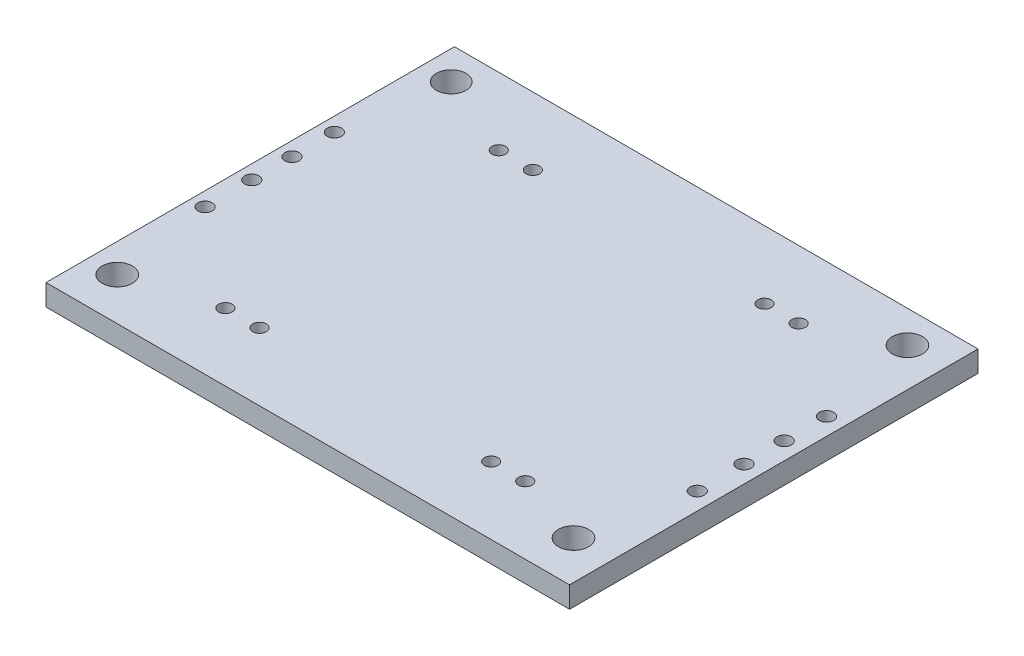
ISO-10303-21;
HEADER;
FILE_DESCRIPTION(('STEP AP214'),'2;1');
FILE_NAME('part.step','',(''),(''),'','','');
FILE_SCHEMA(('AUTOMOTIVE_DESIGN { 1 0 10303 214 1 1 1 1 }'));
ENDSEC;
DATA;
#1=APPLICATION_CONTEXT('core data for automotive mechanical design processes');
#2=APPLICATION_PROTOCOL_DEFINITION('international standard','automotive_design',2000,#1);
#3=PRODUCT_CONTEXT('',#1,'mechanical');
#4=PRODUCT('Part','Part','',(#3));
#5=PRODUCT_RELATED_PRODUCT_CATEGORY('part','',(#4));
#6=PRODUCT_DEFINITION_FORMATION('','',#4);
#7=PRODUCT_DEFINITION_CONTEXT('part definition',#1,'design');
#8=PRODUCT_DEFINITION('design','',#6,#7);
#9=PRODUCT_DEFINITION_SHAPE('','',#8);
#10=(LENGTH_UNIT() NAMED_UNIT(*) SI_UNIT(.MILLI.,.METRE.));
#11=(NAMED_UNIT(*) PLANE_ANGLE_UNIT() SI_UNIT($,.RADIAN.));
#12=(NAMED_UNIT(*) SI_UNIT($,.STERADIAN.) SOLID_ANGLE_UNIT());
#13=UNCERTAINTY_MEASURE_WITH_UNIT(LENGTH_MEASURE(1.E-05),#10,'distance_accuracy_value','');
#14=(GEOMETRIC_REPRESENTATION_CONTEXT(3) GLOBAL_UNCERTAINTY_ASSIGNED_CONTEXT((#13)) GLOBAL_UNIT_ASSIGNED_CONTEXT((#10,
#11,#12)) REPRESENTATION_CONTEXT('',''));
#15=CARTESIAN_POINT('',(0.,0.,0.));
#16=DIRECTION('',(0.,0.,1.));
#17=DIRECTION('',(1.,0.,0.));
#18=AXIS2_PLACEMENT_3D('',#15,#16,#17);
#19=CARTESIAN_POINT('',(-15.425,1.25,12.035));
#20=DIRECTION('',(1.,0.,0.));
#21=DIRECTION('',(0.,0.,-1.));
#22=AXIS2_PLACEMENT_3D('',#19,#20,#21);
#23=PLANE('',#22);
#24=DIRECTION('',(0.,0.,1.));
#25=VECTOR('',#24,1.);
#26=CARTESIAN_POINT('',(-15.425,0.,12.035));
#27=LINE('',#26,#25);
#28=CARTESIAN_POINT('',(-15.425,0.,-12.035));
#29=VERTEX_POINT('',#28);
#30=CARTESIAN_POINT('',(-15.425,0.,12.035));
#31=VERTEX_POINT('',#30);
#32=EDGE_CURVE('E101',#29,#31,#27,.T.);
#33=ORIENTED_EDGE('',*,*,#32,.T.);
#34=DIRECTION('',(0.,-1.,0.));
#35=VECTOR('',#34,1.);
#36=CARTESIAN_POINT('',(-15.425,1.25,12.035));
#37=LINE('',#36,#35);
#38=CARTESIAN_POINT('',(-15.425,1.25,12.035));
#39=VERTEX_POINT('',#38);
#40=EDGE_CURVE('E11',#39,#31,#37,.T.);
#41=ORIENTED_EDGE('',*,*,#40,.F.);
#42=DIRECTION('',(0.,0.,1.));
#43=VECTOR('',#42,1.);
#44=CARTESIAN_POINT('',(-15.425,1.25,12.035));
#45=LINE('',#44,#43);
#46=CARTESIAN_POINT('',(-15.425,1.25,-12.035));
#47=VERTEX_POINT('',#46);
#48=EDGE_CURVE('E88',#47,#39,#45,.T.);
#49=ORIENTED_EDGE('',*,*,#48,.F.);
#50=DIRECTION('',(0.,-1.,0.));
#51=VECTOR('',#50,1.);
#52=CARTESIAN_POINT('',(-15.425,1.25,-12.035));
#53=LINE('',#52,#51);
#54=EDGE_CURVE('E97',#47,#29,#53,.T.);
#55=ORIENTED_EDGE('',*,*,#54,.T.);
#56=EDGE_LOOP('',(#33,#41,#49,#55));
#57=FACE_BOUND('',#56,.T.);
#58=ADVANCED_FACE('F35',(#57),#23,.F.);
#59=CARTESIAN_POINT('',(15.425,1.25,12.035));
#60=DIRECTION('',(0.,0.,-1.));
#61=DIRECTION('',(-1.,0.,0.));
#62=AXIS2_PLACEMENT_3D('',#59,#60,#61);
#63=PLANE('',#62);
#64=DIRECTION('',(1.,0.,0.));
#65=VECTOR('',#64,1.);
#66=CARTESIAN_POINT('',(15.425,0.,12.035));
#67=LINE('',#66,#65);
#68=CARTESIAN_POINT('',(15.425,0.,12.035));
#69=VERTEX_POINT('',#68);
#70=EDGE_CURVE('E92',#31,#69,#67,.T.);
#71=ORIENTED_EDGE('',*,*,#70,.T.);
#72=DIRECTION('',(0.,-1.,0.));
#73=VECTOR('',#72,1.);
#74=CARTESIAN_POINT('',(15.425,1.25,12.035));
#75=LINE('',#74,#73);
#76=CARTESIAN_POINT('',(15.425,1.25,12.035));
#77=VERTEX_POINT('',#76);
#78=EDGE_CURVE('E44',#77,#69,#75,.T.);
#79=ORIENTED_EDGE('',*,*,#78,.F.);
#80=DIRECTION('',(1.,0.,0.));
#81=VECTOR('',#80,1.);
#82=CARTESIAN_POINT('',(15.425,1.25,12.035));
#83=LINE('',#82,#81);
#84=EDGE_CURVE('E83',#39,#77,#83,.T.);
#85=ORIENTED_EDGE('',*,*,#84,.F.);
#86=ORIENTED_EDGE('',*,*,#40,.T.);
#87=EDGE_LOOP('',(#71,#79,#85,#86));
#88=FACE_BOUND('',#87,.T.);
#89=ADVANCED_FACE('F91',(#88),#63,.F.);
#90=CARTESIAN_POINT('',(15.425,1.25,12.035));
#91=DIRECTION('',(-1.,0.,0.));
#92=DIRECTION('',(0.,0.,1.));
#93=AXIS2_PLACEMENT_3D('',#90,#91,#92);
#94=PLANE('',#93);
#95=DIRECTION('',(0.,0.,-1.));
#96=VECTOR('',#95,1.);
#97=CARTESIAN_POINT('',(15.425,0.,12.035));
#98=LINE('',#97,#96);
#99=CARTESIAN_POINT('',(15.425,0.,-12.035));
#100=VERTEX_POINT('',#99);
#101=EDGE_CURVE('E70',#69,#100,#98,.T.);
#102=ORIENTED_EDGE('',*,*,#101,.T.);
#103=DIRECTION('',(0.,-1.,0.));
#104=VECTOR('',#103,1.);
#105=CARTESIAN_POINT('',(15.425,1.25,-12.035));
#106=LINE('',#105,#104);
#107=CARTESIAN_POINT('',(15.425,1.25,-12.035));
#108=VERTEX_POINT('',#107);
#109=EDGE_CURVE('E93',#108,#100,#106,.T.);
#110=ORIENTED_EDGE('',*,*,#109,.F.);
#111=DIRECTION('',(0.,0.,-1.));
#112=VECTOR('',#111,1.);
#113=CARTESIAN_POINT('',(15.425,1.25,12.035));
#114=LINE('',#113,#112);
#115=EDGE_CURVE('E86',#77,#108,#114,.T.);
#116=ORIENTED_EDGE('',*,*,#115,.F.);
#117=ORIENTED_EDGE('',*,*,#78,.T.);
#118=EDGE_LOOP('',(#102,#110,#116,#117));
#119=FACE_BOUND('',#118,.T.);
#120=ADVANCED_FACE('F95',(#119),#94,.F.);
#121=CARTESIAN_POINT('',(15.425,1.25,-12.035));
#122=DIRECTION('',(0.,0.,1.));
#123=DIRECTION('',(1.,0.,0.));
#124=AXIS2_PLACEMENT_3D('',#121,#122,#123);
#125=PLANE('',#124);
#126=DIRECTION('',(-1.,0.,0.));
#127=VECTOR('',#126,1.);
#128=CARTESIAN_POINT('',(15.425,0.,-12.035));
#129=LINE('',#128,#127);
#130=EDGE_CURVE('E76',#100,#29,#129,.T.);
#131=ORIENTED_EDGE('',*,*,#130,.T.);
#132=ORIENTED_EDGE('',*,*,#54,.F.);
#133=DIRECTION('',(-1.,0.,0.));
#134=VECTOR('',#133,1.);
#135=CARTESIAN_POINT('',(15.425,1.25,-12.035));
#136=LINE('',#135,#134);
#137=EDGE_CURVE('E53',#108,#47,#136,.T.);
#138=ORIENTED_EDGE('',*,*,#137,.F.);
#139=ORIENTED_EDGE('',*,*,#109,.T.);
#140=EDGE_LOOP('',(#131,#132,#138,#139));
#141=FACE_BOUND('',#140,.T.);
#142=ADVANCED_FACE('F201',(#141),#125,.F.);
#143=CARTESIAN_POINT('',(0.,1.25,0.));
#144=DIRECTION('',(0.,1.,0.));
#145=DIRECTION('',(0.,0.,1.));
#146=AXIS2_PLACEMENT_3D('',#143,#144,#145);
#147=PLANE('',#146);
#148=CARTESIAN_POINT('',(-14.5999269893961,1.25,-1.63509921584506));
#149=DIRECTION('',(0.,1.,0.));
#150=DIRECTION('',(0.,0.,1.));
#151=AXIS2_PLACEMENT_3D('',#148,#149,#150);
#152=CIRCLE('',#151,0.421818831160271);
#153=CARTESIAN_POINT('',(-14.5999269893961,1.25,-1.21328038468479));
#154=VERTEX_POINT('',#153);
#155=EDGE_CURVE('E439',#154,#154,#152,.F.);
#156=ORIENTED_EDGE('',*,*,#155,.T.);
#157=EDGE_LOOP('',(#156));
#158=FACE_BOUND('',#157,.T.);
#159=CARTESIAN_POINT('',(-14.5999269893961,1.25,0.73383923728869));
#160=DIRECTION('',(0.,1.,0.));
#161=DIRECTION('',(0.,0.,1.));
#162=AXIS2_PLACEMENT_3D('',#159,#160,#161);
#163=CIRCLE('',#162,0.421818831160272);
#164=CARTESIAN_POINT('',(-14.5999269893961,1.25,1.15565806844896));
#165=VERTEX_POINT('',#164);
#166=EDGE_CURVE('E449',#165,#165,#163,.F.);
#167=ORIENTED_EDGE('',*,*,#166,.T.);
#168=EDGE_LOOP('',(#167));
#169=FACE_BOUND('',#168,.T.);
#170=CARTESIAN_POINT('',(-14.5999269893961,1.25,3.48692987201169));
#171=DIRECTION('',(0.,1.,0.));
#172=DIRECTION('',(0.,0.,1.));
#173=AXIS2_PLACEMENT_3D('',#170,#171,#172);
#174=CIRCLE('',#173,0.421818831160271);
#175=CARTESIAN_POINT('',(-14.5999269893961,1.25,3.90874870317196));
#176=VERTEX_POINT('',#175);
#177=EDGE_CURVE('E455',#176,#176,#174,.F.);
#178=ORIENTED_EDGE('',*,*,#177,.T.);
#179=EDGE_LOOP('',(#178));
#180=FACE_BOUND('',#179,.T.);
#181=CARTESIAN_POINT('',(14.4035627205928,1.25,3.48692987201169));
#182=DIRECTION('',(0.,1.,0.));
#183=DIRECTION('',(0.,0.,1.));
#184=AXIS2_PLACEMENT_3D('',#181,#182,#183);
#185=CIRCLE('',#184,0.421818831160271);
#186=CARTESIAN_POINT('',(14.4035627205928,1.25,3.90874870317196));
#187=VERTEX_POINT('',#186);
#188=EDGE_CURVE('E461',#187,#187,#185,.F.);
#189=ORIENTED_EDGE('',*,*,#188,.T.);
#190=EDGE_LOOP('',(#189));
#191=FACE_BOUND('',#190,.T.);
#192=CARTESIAN_POINT('',(14.4035627205928,1.25,0.73383923728869));
#193=DIRECTION('',(0.,1.,0.));
#194=DIRECTION('',(0.,0.,1.));
#195=AXIS2_PLACEMENT_3D('',#192,#193,#194);
#196=CIRCLE('',#195,0.421818831160272);
#197=CARTESIAN_POINT('',(14.4035627205928,1.25,1.15565806844896));
#198=VERTEX_POINT('',#197);
#199=EDGE_CURVE('E467',#198,#198,#196,.F.);
#200=ORIENTED_EDGE('',*,*,#199,.T.);
#201=EDGE_LOOP('',(#200));
#202=FACE_BOUND('',#201,.T.);
#203=CARTESIAN_POINT('',(14.4035627205928,1.25,-1.63509921584506));
#204=DIRECTION('',(0.,1.,0.));
#205=DIRECTION('',(0.,0.,1.));
#206=AXIS2_PLACEMENT_3D('',#203,#204,#205);
#207=CIRCLE('',#206,0.421818831160271);
#208=CARTESIAN_POINT('',(14.4035627205928,1.25,-1.21328038468479));
#209=VERTEX_POINT('',#208);
#210=EDGE_CURVE('E473',#209,#209,#207,.F.);
#211=ORIENTED_EDGE('',*,*,#210,.T.);
#212=EDGE_LOOP('',(#211));
#213=FACE_BOUND('',#212,.T.);
#214=CARTESIAN_POINT('',(-14.5999269893961,1.25,-4.13208839617523));
#215=DIRECTION('',(0.,1.,0.));
#216=DIRECTION('',(0.,0.,1.));
#217=AXIS2_PLACEMENT_3D('',#214,#215,#216);
#218=CIRCLE('',#217,0.421818831160272);
#219=CARTESIAN_POINT('',(-14.5999269893961,1.25,-3.71026956501496));
#220=VERTEX_POINT('',#219);
#221=EDGE_CURVE('E479',#220,#220,#218,.F.);
#222=ORIENTED_EDGE('',*,*,#221,.T.);
#223=EDGE_LOOP('',(#222));
#224=FACE_BOUND('',#223,.T.);
#225=CARTESIAN_POINT('',(14.4035627205928,1.25,-4.13208839617523));
#226=DIRECTION('',(0.,1.,0.));
#227=DIRECTION('',(0.,0.,1.));
#228=AXIS2_PLACEMENT_3D('',#225,#226,#227);
#229=CIRCLE('',#228,0.421818831160272);
#230=CARTESIAN_POINT('',(14.4035627205928,1.25,-3.71026956501496));
#231=VERTEX_POINT('',#230);
#232=EDGE_CURVE('E161',#231,#231,#229,.F.);
#233=ORIENTED_EDGE('',*,*,#232,.T.);
#234=EDGE_LOOP('',(#233));
#235=FACE_BOUND('',#234,.T.);
#236=CARTESIAN_POINT('',(8.83499999999999,1.25,8.055));
#237=DIRECTION('',(0.,1.,0.));
#238=DIRECTION('',(0.,0.,1.));
#239=AXIS2_PLACEMENT_3D('',#236,#237,#238);
#240=CIRCLE('',#239,0.399999999999999);
#241=CARTESIAN_POINT('',(8.83499999999999,1.25,8.455));
#242=VERTEX_POINT('',#241);
#243=EDGE_CURVE('E151',#242,#242,#240,.F.);
#244=ORIENTED_EDGE('',*,*,#243,.T.);
#245=EDGE_LOOP('',(#244));
#246=FACE_BOUND('',#245,.T.);
#247=CARTESIAN_POINT('',(6.82499999999999,1.25,8.055));
#248=DIRECTION('',(0.,1.,0.));
#249=DIRECTION('',(0.,0.,1.));
#250=AXIS2_PLACEMENT_3D('',#247,#248,#249);
#251=CIRCLE('',#250,0.4);
#252=CARTESIAN_POINT('',(6.82499999999999,1.25,8.455));
#253=VERTEX_POINT('',#252);
#254=EDGE_CURVE('E148',#253,#253,#251,.F.);
#255=ORIENTED_EDGE('',*,*,#254,.T.);
#256=EDGE_LOOP('',(#255));
#257=FACE_BOUND('',#256,.T.);
#258=CARTESIAN_POINT('',(-6.82500000000002,1.25,8.055));
#259=DIRECTION('',(0.,1.,0.));
#260=DIRECTION('',(0.,0.,1.));
#261=AXIS2_PLACEMENT_3D('',#258,#259,#260);
#262=CIRCLE('',#261,0.4);
#263=CARTESIAN_POINT('',(-6.82500000000002,1.25,8.455));
#264=VERTEX_POINT('',#263);
#265=EDGE_CURVE('E145',#264,#264,#262,.F.);
#266=ORIENTED_EDGE('',*,*,#265,.T.);
#267=EDGE_LOOP('',(#266));
#268=FACE_BOUND('',#267,.T.);
#269=CARTESIAN_POINT('',(-8.83500000000002,1.25,8.055));
#270=DIRECTION('',(0.,1.,0.));
#271=DIRECTION('',(0.,0.,1.));
#272=AXIS2_PLACEMENT_3D('',#269,#270,#271);
#273=CIRCLE('',#272,0.399999999999999);
#274=CARTESIAN_POINT('',(-8.83500000000002,1.25,8.455));
#275=VERTEX_POINT('',#274);
#276=EDGE_CURVE('E141',#275,#275,#273,.F.);
#277=ORIENTED_EDGE('',*,*,#276,.T.);
#278=EDGE_LOOP('',(#277));
#279=FACE_BOUND('',#278,.T.);
#280=CARTESIAN_POINT('',(8.83499999999999,1.25,-8.05500000000001));
#281=DIRECTION('',(0.,1.,0.));
#282=DIRECTION('',(0.,0.,1.));
#283=AXIS2_PLACEMENT_3D('',#280,#281,#282);
#284=CIRCLE('',#283,0.399999999999999);
#285=CARTESIAN_POINT('',(8.83499999999999,1.25,-7.65500000000001));
#286=VERTEX_POINT('',#285);
#287=EDGE_CURVE('E137',#286,#286,#284,.F.);
#288=ORIENTED_EDGE('',*,*,#287,.T.);
#289=EDGE_LOOP('',(#288));
#290=FACE_BOUND('',#289,.T.);
#291=CARTESIAN_POINT('',(6.82499999999999,1.25,-8.05500000000001));
#292=DIRECTION('',(0.,1.,0.));
#293=DIRECTION('',(0.,0.,1.));
#294=AXIS2_PLACEMENT_3D('',#291,#292,#293);
#295=CIRCLE('',#294,0.4);
#296=CARTESIAN_POINT('',(6.82499999999999,1.25,-7.65500000000001));
#297=VERTEX_POINT('',#296);
#298=EDGE_CURVE('E133',#297,#297,#295,.F.);
#299=ORIENTED_EDGE('',*,*,#298,.T.);
#300=EDGE_LOOP('',(#299));
#301=FACE_BOUND('',#300,.T.);
#302=CARTESIAN_POINT('',(-6.82500000000002,1.25,-8.05500000000001));
#303=DIRECTION('',(0.,1.,0.));
#304=DIRECTION('',(0.,0.,1.));
#305=AXIS2_PLACEMENT_3D('',#302,#303,#304);
#306=CIRCLE('',#305,0.4);
#307=CARTESIAN_POINT('',(-6.82500000000002,1.25,-7.65500000000001));
#308=VERTEX_POINT('',#307);
#309=EDGE_CURVE('E129',#308,#308,#306,.F.);
#310=ORIENTED_EDGE('',*,*,#309,.T.);
#311=EDGE_LOOP('',(#310));
#312=FACE_BOUND('',#311,.T.);
#313=CARTESIAN_POINT('',(-8.83500000000002,1.25,-8.05500000000001));
#314=DIRECTION('',(0.,1.,0.));
#315=DIRECTION('',(0.,0.,1.));
#316=AXIS2_PLACEMENT_3D('',#313,#314,#315);
#317=CIRCLE('',#316,0.399999999999999);
#318=CARTESIAN_POINT('',(-8.83500000000002,1.25,-7.65500000000001));
#319=VERTEX_POINT('',#318);
#320=EDGE_CURVE('E125',#319,#319,#317,.F.);
#321=ORIENTED_EDGE('',*,*,#320,.T.);
#322=EDGE_LOOP('',(#321));
#323=FACE_BOUND('',#322,.T.);
#324=CARTESIAN_POINT('',(13.1564748496622,1.25,-10.145));
#325=DIRECTION('',(0.,1.,0.));
#326=DIRECTION('',(0.,0.,1.));
#327=AXIS2_PLACEMENT_3D('',#324,#325,#326);
#328=CIRCLE('',#327,0.89);
#329=CARTESIAN_POINT('',(13.1564748496622,1.25,-9.255));
#330=VERTEX_POINT('',#329);
#331=EDGE_CURVE('E121',#330,#330,#328,.F.);
#332=ORIENTED_EDGE('',*,*,#331,.T.);
#333=EDGE_LOOP('',(#332));
#334=FACE_BOUND('',#333,.T.);
#335=CARTESIAN_POINT('',(13.1564748496622,1.25,9.53302600088245));
#336=DIRECTION('',(0.,1.,0.));
#337=DIRECTION('',(0.,0.,1.));
#338=AXIS2_PLACEMENT_3D('',#335,#336,#337);
#339=CIRCLE('',#338,0.89);
#340=CARTESIAN_POINT('',(13.1564748496622,1.25,10.4230260008824));
#341=VERTEX_POINT('',#340);
#342=EDGE_CURVE('E117',#341,#341,#339,.F.);
#343=ORIENTED_EDGE('',*,*,#342,.T.);
#344=EDGE_LOOP('',(#343));
#345=FACE_BOUND('',#344,.T.);
#346=CARTESIAN_POINT('',(-13.7287293984571,1.25,9.53302600088245));
#347=DIRECTION('',(0.,1.,0.));
#348=DIRECTION('',(0.,0.,1.));
#349=AXIS2_PLACEMENT_3D('',#346,#347,#348);
#350=CIRCLE('',#349,0.89);
#351=CARTESIAN_POINT('',(-13.7287293984571,1.25,10.4230260008824));
#352=VERTEX_POINT('',#351);
#353=EDGE_CURVE('E113',#352,#352,#350,.F.);
#354=ORIENTED_EDGE('',*,*,#353,.T.);
#355=EDGE_LOOP('',(#354));
#356=FACE_BOUND('',#355,.T.);
#357=CARTESIAN_POINT('',(-13.7287293984571,1.25,-10.145));
#358=DIRECTION('',(0.,1.,0.));
#359=DIRECTION('',(0.,0.,1.));
#360=AXIS2_PLACEMENT_3D('',#357,#358,#359);
#361=CIRCLE('',#360,0.872176239455394);
#362=CARTESIAN_POINT('',(-13.7287293984571,1.25,-9.27282376054461));
#363=VERTEX_POINT('',#362);
#364=EDGE_CURVE('E104',#363,#363,#361,.F.);
#365=ORIENTED_EDGE('',*,*,#364,.T.);
#366=EDGE_LOOP('',(#365));
#367=FACE_BOUND('',#366,.T.);
#368=ORIENTED_EDGE('',*,*,#48,.T.);
#369=ORIENTED_EDGE('',*,*,#84,.T.);
#370=ORIENTED_EDGE('',*,*,#115,.T.);
#371=ORIENTED_EDGE('',*,*,#137,.T.);
#372=EDGE_LOOP('',(#368,#369,#370,#371));
#373=FACE_BOUND('',#372,.T.);
#374=ADVANCED_FACE('F84',(#158,#169,#180,#191,#202,#213,#224,#235,#246,#257,#268,#279,#290,#301,
#312,#323,#334,#345,#356,#367,#373),#147,.T.);
#375=CARTESIAN_POINT('',(0.,0.,0.));
#376=DIRECTION('',(0.,1.,0.));
#377=DIRECTION('',(0.,0.,1.));
#378=AXIS2_PLACEMENT_3D('',#375,#376,#377);
#379=PLANE('',#378);
#380=CARTESIAN_POINT('',(-14.5999269893961,0.,-1.63509921584506));
#381=DIRECTION('',(0.,1.,0.));
#382=DIRECTION('',(0.,0.,1.));
#383=AXIS2_PLACEMENT_3D('',#380,#381,#382);
#384=CIRCLE('',#383,0.399999999999999);
#385=CARTESIAN_POINT('',(-14.5999269893961,0.,-1.23509921584506));
#386=VERTEX_POINT('',#385);
#387=EDGE_CURVE('E442',#386,#386,#384,.T.);
#388=ORIENTED_EDGE('',*,*,#387,.T.);
#389=EDGE_LOOP('',(#388));
#390=FACE_BOUND('',#389,.T.);
#391=CARTESIAN_POINT('',(-14.5999269893961,0.,0.73383923728869));
#392=DIRECTION('',(0.,1.,0.));
#393=DIRECTION('',(0.,0.,1.));
#394=AXIS2_PLACEMENT_3D('',#391,#392,#393);
#395=CIRCLE('',#394,0.4);
#396=CARTESIAN_POINT('',(-14.5999269893961,0.,1.13383923728869));
#397=VERTEX_POINT('',#396);
#398=EDGE_CURVE('E444',#397,#397,#395,.T.);
#399=ORIENTED_EDGE('',*,*,#398,.T.);
#400=EDGE_LOOP('',(#399));
#401=FACE_BOUND('',#400,.T.);
#402=CARTESIAN_POINT('',(-14.5999269893961,0.,3.48692987201169));
#403=DIRECTION('',(0.,1.,0.));
#404=DIRECTION('',(0.,0.,1.));
#405=AXIS2_PLACEMENT_3D('',#402,#403,#404);
#406=CIRCLE('',#405,0.399999999999999);
#407=CARTESIAN_POINT('',(-14.5999269893961,0.,3.88692987201169));
#408=VERTEX_POINT('',#407);
#409=EDGE_CURVE('E452',#408,#408,#406,.T.);
#410=ORIENTED_EDGE('',*,*,#409,.T.);
#411=EDGE_LOOP('',(#410));
#412=FACE_BOUND('',#411,.T.);
#413=CARTESIAN_POINT('',(14.4035627205928,0.,3.48692987201169));
#414=DIRECTION('',(0.,1.,0.));
#415=DIRECTION('',(0.,0.,1.));
#416=AXIS2_PLACEMENT_3D('',#413,#414,#415);
#417=CIRCLE('',#416,0.399999999999999);
#418=CARTESIAN_POINT('',(14.4035627205928,0.,3.88692987201169));
#419=VERTEX_POINT('',#418);
#420=EDGE_CURVE('E458',#419,#419,#417,.T.);
#421=ORIENTED_EDGE('',*,*,#420,.T.);
#422=EDGE_LOOP('',(#421));
#423=FACE_BOUND('',#422,.T.);
#424=CARTESIAN_POINT('',(14.4035627205928,0.,0.73383923728869));
#425=DIRECTION('',(0.,1.,0.));
#426=DIRECTION('',(0.,0.,1.));
#427=AXIS2_PLACEMENT_3D('',#424,#425,#426);
#428=CIRCLE('',#427,0.4);
#429=CARTESIAN_POINT('',(14.4035627205928,0.,1.13383923728869));
#430=VERTEX_POINT('',#429);
#431=EDGE_CURVE('E464',#430,#430,#428,.T.);
#432=ORIENTED_EDGE('',*,*,#431,.T.);
#433=EDGE_LOOP('',(#432));
#434=FACE_BOUND('',#433,.T.);
#435=CARTESIAN_POINT('',(14.4035627205928,0.,-1.63509921584506));
#436=DIRECTION('',(0.,1.,0.));
#437=DIRECTION('',(0.,0.,1.));
#438=AXIS2_PLACEMENT_3D('',#435,#436,#437);
#439=CIRCLE('',#438,0.399999999999999);
#440=CARTESIAN_POINT('',(14.4035627205928,0.,-1.23509921584506));
#441=VERTEX_POINT('',#440);
#442=EDGE_CURVE('E470',#441,#441,#439,.T.);
#443=ORIENTED_EDGE('',*,*,#442,.T.);
#444=EDGE_LOOP('',(#443));
#445=FACE_BOUND('',#444,.T.);
#446=CARTESIAN_POINT('',(-14.5999269893961,0.,-4.13208839617523));
#447=DIRECTION('',(0.,1.,0.));
#448=DIRECTION('',(0.,0.,1.));
#449=AXIS2_PLACEMENT_3D('',#446,#447,#448);
#450=CIRCLE('',#449,0.4);
#451=CARTESIAN_POINT('',(-14.5999269893961,0.,-3.73208839617523));
#452=VERTEX_POINT('',#451);
#453=EDGE_CURVE('E476',#452,#452,#450,.T.);
#454=ORIENTED_EDGE('',*,*,#453,.T.);
#455=EDGE_LOOP('',(#454));
#456=FACE_BOUND('',#455,.T.);
#457=CARTESIAN_POINT('',(14.4035627205928,0.,-4.13208839617523));
#458=DIRECTION('',(0.,1.,0.));
#459=DIRECTION('',(0.,0.,1.));
#460=AXIS2_PLACEMENT_3D('',#457,#458,#459);
#461=CIRCLE('',#460,0.4);
#462=CARTESIAN_POINT('',(14.4035627205928,0.,-3.73208839617523));
#463=VERTEX_POINT('',#462);
#464=EDGE_CURVE('E481',#463,#463,#461,.T.);
#465=ORIENTED_EDGE('',*,*,#464,.T.);
#466=EDGE_LOOP('',(#465));
#467=FACE_BOUND('',#466,.T.);
#468=CARTESIAN_POINT('',(8.83499999999999,0.,8.055));
#469=DIRECTION('',(0.,1.,0.));
#470=DIRECTION('',(0.,0.,1.));
#471=AXIS2_PLACEMENT_3D('',#468,#469,#470);
#472=CIRCLE('',#471,0.399999999999999);
#473=CARTESIAN_POINT('',(8.83499999999999,0.,8.455));
#474=VERTEX_POINT('',#473);
#475=EDGE_CURVE('E38',#474,#474,#472,.F.);
#476=ORIENTED_EDGE('',*,*,#475,.F.);
#477=EDGE_LOOP('',(#476));
#478=FACE_BOUND('',#477,.T.);
#479=CARTESIAN_POINT('',(6.82499999999999,0.,8.055));
#480=DIRECTION('',(0.,1.,0.));
#481=DIRECTION('',(0.,0.,1.));
#482=AXIS2_PLACEMENT_3D('',#479,#480,#481);
#483=CIRCLE('',#482,0.4);
#484=CARTESIAN_POINT('',(6.82499999999999,0.,8.455));
#485=VERTEX_POINT('',#484);
#486=EDGE_CURVE('E149',#485,#485,#483,.F.);
#487=ORIENTED_EDGE('',*,*,#486,.F.);
#488=EDGE_LOOP('',(#487));
#489=FACE_BOUND('',#488,.T.);
#490=CARTESIAN_POINT('',(-6.82500000000002,0.,8.055));
#491=DIRECTION('',(0.,1.,0.));
#492=DIRECTION('',(0.,0.,1.));
#493=AXIS2_PLACEMENT_3D('',#490,#491,#492);
#494=CIRCLE('',#493,0.4);
#495=CARTESIAN_POINT('',(-6.82500000000002,0.,8.455));
#496=VERTEX_POINT('',#495);
#497=EDGE_CURVE('E146',#496,#496,#494,.F.);
#498=ORIENTED_EDGE('',*,*,#497,.F.);
#499=EDGE_LOOP('',(#498));
#500=FACE_BOUND('',#499,.T.);
#501=CARTESIAN_POINT('',(-8.83500000000002,0.,8.055));
#502=DIRECTION('',(0.,1.,0.));
#503=DIRECTION('',(0.,0.,1.));
#504=AXIS2_PLACEMENT_3D('',#501,#502,#503);
#505=CIRCLE('',#504,0.399999999999999);
#506=CARTESIAN_POINT('',(-8.83500000000002,0.,8.455));
#507=VERTEX_POINT('',#506);
#508=EDGE_CURVE('E142',#507,#507,#505,.F.);
#509=ORIENTED_EDGE('',*,*,#508,.F.);
#510=EDGE_LOOP('',(#509));
#511=FACE_BOUND('',#510,.T.);
#512=CARTESIAN_POINT('',(8.83499999999999,0.,-8.05500000000001));
#513=DIRECTION('',(0.,1.,0.));
#514=DIRECTION('',(0.,0.,1.));
#515=AXIS2_PLACEMENT_3D('',#512,#513,#514);
#516=CIRCLE('',#515,0.399999999999999);
#517=CARTESIAN_POINT('',(8.83499999999999,0.,-7.65500000000001));
#518=VERTEX_POINT('',#517);
#519=EDGE_CURVE('E138',#518,#518,#516,.F.);
#520=ORIENTED_EDGE('',*,*,#519,.F.);
#521=EDGE_LOOP('',(#520));
#522=FACE_BOUND('',#521,.T.);
#523=CARTESIAN_POINT('',(6.82499999999999,0.,-8.05500000000001));
#524=DIRECTION('',(0.,1.,0.));
#525=DIRECTION('',(0.,0.,1.));
#526=AXIS2_PLACEMENT_3D('',#523,#524,#525);
#527=CIRCLE('',#526,0.4);
#528=CARTESIAN_POINT('',(6.82499999999999,0.,-7.65500000000001));
#529=VERTEX_POINT('',#528);
#530=EDGE_CURVE('E134',#529,#529,#527,.F.);
#531=ORIENTED_EDGE('',*,*,#530,.F.);
#532=EDGE_LOOP('',(#531));
#533=FACE_BOUND('',#532,.T.);
#534=CARTESIAN_POINT('',(-6.82500000000002,0.,-8.05500000000001));
#535=DIRECTION('',(0.,1.,0.));
#536=DIRECTION('',(0.,0.,1.));
#537=AXIS2_PLACEMENT_3D('',#534,#535,#536);
#538=CIRCLE('',#537,0.4);
#539=CARTESIAN_POINT('',(-6.82500000000002,0.,-7.65500000000001));
#540=VERTEX_POINT('',#539);
#541=EDGE_CURVE('E130',#540,#540,#538,.F.);
#542=ORIENTED_EDGE('',*,*,#541,.F.);
#543=EDGE_LOOP('',(#542));
#544=FACE_BOUND('',#543,.T.);
#545=CARTESIAN_POINT('',(-8.83500000000002,0.,-8.05500000000001));
#546=DIRECTION('',(0.,1.,0.));
#547=DIRECTION('',(0.,0.,1.));
#548=AXIS2_PLACEMENT_3D('',#545,#546,#547);
#549=CIRCLE('',#548,0.399999999999999);
#550=CARTESIAN_POINT('',(-8.83500000000002,0.,-7.65500000000001));
#551=VERTEX_POINT('',#550);
#552=EDGE_CURVE('E126',#551,#551,#549,.F.);
#553=ORIENTED_EDGE('',*,*,#552,.F.);
#554=EDGE_LOOP('',(#553));
#555=FACE_BOUND('',#554,.T.);
#556=CARTESIAN_POINT('',(13.1564748496622,0.,-10.145));
#557=DIRECTION('',(0.,1.,0.));
#558=DIRECTION('',(0.,0.,1.));
#559=AXIS2_PLACEMENT_3D('',#556,#557,#558);
#560=CIRCLE('',#559,0.89);
#561=CARTESIAN_POINT('',(13.1564748496622,0.,-9.255));
#562=VERTEX_POINT('',#561);
#563=EDGE_CURVE('E122',#562,#562,#560,.F.);
#564=ORIENTED_EDGE('',*,*,#563,.F.);
#565=EDGE_LOOP('',(#564));
#566=FACE_BOUND('',#565,.T.);
#567=CARTESIAN_POINT('',(13.1564748496622,0.,9.53302600088245));
#568=DIRECTION('',(0.,1.,0.));
#569=DIRECTION('',(0.,0.,1.));
#570=AXIS2_PLACEMENT_3D('',#567,#568,#569);
#571=CIRCLE('',#570,0.89);
#572=CARTESIAN_POINT('',(13.1564748496622,0.,10.4230260008824));
#573=VERTEX_POINT('',#572);
#574=EDGE_CURVE('E118',#573,#573,#571,.F.);
#575=ORIENTED_EDGE('',*,*,#574,.F.);
#576=EDGE_LOOP('',(#575));
#577=FACE_BOUND('',#576,.T.);
#578=CARTESIAN_POINT('',(-13.7287293984571,0.,9.53302600088245));
#579=DIRECTION('',(0.,1.,0.));
#580=DIRECTION('',(0.,0.,1.));
#581=AXIS2_PLACEMENT_3D('',#578,#579,#580);
#582=CIRCLE('',#581,0.89);
#583=CARTESIAN_POINT('',(-13.7287293984571,0.,10.4230260008824));
#584=VERTEX_POINT('',#583);
#585=EDGE_CURVE('E114',#584,#584,#582,.F.);
#586=ORIENTED_EDGE('',*,*,#585,.F.);
#587=EDGE_LOOP('',(#586));
#588=FACE_BOUND('',#587,.T.);
#589=CARTESIAN_POINT('',(-13.7287293984571,0.,-10.145));
#590=DIRECTION('',(0.,1.,0.));
#591=DIRECTION('',(0.,0.,1.));
#592=AXIS2_PLACEMENT_3D('',#589,#590,#591);
#593=CIRCLE('',#592,0.872176239455394);
#594=CARTESIAN_POINT('',(-13.7287293984571,0.,-9.27282376054461));
#595=VERTEX_POINT('',#594);
#596=EDGE_CURVE('E110',#595,#595,#593,.F.);
#597=ORIENTED_EDGE('',*,*,#596,.F.);
#598=EDGE_LOOP('',(#597));
#599=FACE_BOUND('',#598,.T.);
#600=ORIENTED_EDGE('',*,*,#32,.F.);
#601=ORIENTED_EDGE('',*,*,#130,.F.);
#602=ORIENTED_EDGE('',*,*,#101,.F.);
#603=ORIENTED_EDGE('',*,*,#70,.F.);
#604=EDGE_LOOP('',(#600,#601,#602,#603));
#605=FACE_BOUND('',#604,.T.);
#606=ADVANCED_FACE('F191',(#390,#401,#412,#423,#434,#445,#456,#467,#478,#489,#500,#511,#522,
#533,#544,#555,#566,#577,#588,#599,#605),#379,.F.);
#607=CARTESIAN_POINT('',(-13.7287293984571,11.,-10.145));
#608=DIRECTION('',(0.,-1.,0.));
#609=DIRECTION('',(0.,0.,-1.));
#610=AXIS2_PLACEMENT_3D('',#607,#608,#609);
#611=CYLINDRICAL_SURFACE('',#610,0.872176239455394);
#612=ORIENTED_EDGE('',*,*,#364,.F.);
#613=EDGE_LOOP('',(#612));
#614=FACE_BOUND('',#613,.T.);
#615=ORIENTED_EDGE('',*,*,#596,.T.);
#616=EDGE_LOOP('',(#615));
#617=FACE_BOUND('',#616,.T.);
#618=ADVANCED_FACE('F187',(#614,#617),#611,.F.);
#619=CARTESIAN_POINT('',(-13.7287293984571,11.,9.53302600088245));
#620=DIRECTION('',(0.,-1.,0.));
#621=DIRECTION('',(0.,0.,-1.));
#622=AXIS2_PLACEMENT_3D('',#619,#620,#621);
#623=CYLINDRICAL_SURFACE('',#622,0.89);
#624=ORIENTED_EDGE('',*,*,#353,.F.);
#625=EDGE_LOOP('',(#624));
#626=FACE_BOUND('',#625,.T.);
#627=ORIENTED_EDGE('',*,*,#585,.T.);
#628=EDGE_LOOP('',(#627));
#629=FACE_BOUND('',#628,.T.);
#630=ADVANCED_FACE('F190',(#626,#629),#623,.F.);
#631=CARTESIAN_POINT('',(13.1564748496622,11.,9.53302600088245));
#632=DIRECTION('',(0.,-1.,0.));
#633=DIRECTION('',(0.,0.,-1.));
#634=AXIS2_PLACEMENT_3D('',#631,#632,#633);
#635=CYLINDRICAL_SURFACE('',#634,0.89);
#636=ORIENTED_EDGE('',*,*,#342,.F.);
#637=EDGE_LOOP('',(#636));
#638=FACE_BOUND('',#637,.T.);
#639=ORIENTED_EDGE('',*,*,#574,.T.);
#640=EDGE_LOOP('',(#639));
#641=FACE_BOUND('',#640,.T.);
#642=ADVANCED_FACE('F242',(#638,#641),#635,.F.);
#643=CARTESIAN_POINT('',(13.1564748496622,11.,-10.145));
#644=DIRECTION('',(0.,-1.,0.));
#645=DIRECTION('',(0.,0.,-1.));
#646=AXIS2_PLACEMENT_3D('',#643,#644,#645);
#647=CYLINDRICAL_SURFACE('',#646,0.89);
#648=ORIENTED_EDGE('',*,*,#331,.F.);
#649=EDGE_LOOP('',(#648));
#650=FACE_BOUND('',#649,.T.);
#651=ORIENTED_EDGE('',*,*,#563,.T.);
#652=EDGE_LOOP('',(#651));
#653=FACE_BOUND('',#652,.T.);
#654=ADVANCED_FACE('F252',(#650,#653),#647,.F.);
#655=CARTESIAN_POINT('',(-8.83500000000002,11.,-8.05500000000001));
#656=DIRECTION('',(0.,-1.,0.));
#657=DIRECTION('',(0.,0.,-1.));
#658=AXIS2_PLACEMENT_3D('',#655,#656,#657);
#659=CYLINDRICAL_SURFACE('',#658,0.399999999999999);
#660=ORIENTED_EDGE('',*,*,#320,.F.);
#661=EDGE_LOOP('',(#660));
#662=FACE_BOUND('',#661,.T.);
#663=ORIENTED_EDGE('',*,*,#552,.T.);
#664=EDGE_LOOP('',(#663));
#665=FACE_BOUND('',#664,.T.);
#666=ADVANCED_FACE('F262',(#662,#665),#659,.F.);
#667=CARTESIAN_POINT('',(-6.82500000000002,11.,-8.05500000000001));
#668=DIRECTION('',(0.,-1.,0.));
#669=DIRECTION('',(0.,0.,-1.));
#670=AXIS2_PLACEMENT_3D('',#667,#668,#669);
#671=CYLINDRICAL_SURFACE('',#670,0.4);
#672=ORIENTED_EDGE('',*,*,#309,.F.);
#673=EDGE_LOOP('',(#672));
#674=FACE_BOUND('',#673,.T.);
#675=ORIENTED_EDGE('',*,*,#541,.T.);
#676=EDGE_LOOP('',(#675));
#677=FACE_BOUND('',#676,.T.);
#678=ADVANCED_FACE('F272',(#674,#677),#671,.F.);
#679=CARTESIAN_POINT('',(6.82499999999999,11.,-8.05500000000001));
#680=DIRECTION('',(0.,-1.,0.));
#681=DIRECTION('',(0.,0.,-1.));
#682=AXIS2_PLACEMENT_3D('',#679,#680,#681);
#683=CYLINDRICAL_SURFACE('',#682,0.4);
#684=ORIENTED_EDGE('',*,*,#298,.F.);
#685=EDGE_LOOP('',(#684));
#686=FACE_BOUND('',#685,.T.);
#687=ORIENTED_EDGE('',*,*,#530,.T.);
#688=EDGE_LOOP('',(#687));
#689=FACE_BOUND('',#688,.T.);
#690=ADVANCED_FACE('F282',(#686,#689),#683,.F.);
#691=CARTESIAN_POINT('',(8.83499999999999,11.,-8.05500000000001));
#692=DIRECTION('',(0.,-1.,0.));
#693=DIRECTION('',(0.,0.,-1.));
#694=AXIS2_PLACEMENT_3D('',#691,#692,#693);
#695=CYLINDRICAL_SURFACE('',#694,0.399999999999999);
#696=ORIENTED_EDGE('',*,*,#287,.F.);
#697=EDGE_LOOP('',(#696));
#698=FACE_BOUND('',#697,.T.);
#699=ORIENTED_EDGE('',*,*,#519,.T.);
#700=EDGE_LOOP('',(#699));
#701=FACE_BOUND('',#700,.T.);
#702=ADVANCED_FACE('F292',(#698,#701),#695,.F.);
#703=CARTESIAN_POINT('',(-8.83500000000002,11.,8.055));
#704=DIRECTION('',(0.,-1.,0.));
#705=DIRECTION('',(0.,0.,-1.));
#706=AXIS2_PLACEMENT_3D('',#703,#704,#705);
#707=CYLINDRICAL_SURFACE('',#706,0.399999999999999);
#708=ORIENTED_EDGE('',*,*,#276,.F.);
#709=EDGE_LOOP('',(#708));
#710=FACE_BOUND('',#709,.T.);
#711=ORIENTED_EDGE('',*,*,#508,.T.);
#712=EDGE_LOOP('',(#711));
#713=FACE_BOUND('',#712,.T.);
#714=ADVANCED_FACE('F302',(#710,#713),#707,.F.);
#715=CARTESIAN_POINT('',(-6.82500000000002,11.,8.055));
#716=DIRECTION('',(0.,-1.,0.));
#717=DIRECTION('',(0.,0.,-1.));
#718=AXIS2_PLACEMENT_3D('',#715,#716,#717);
#719=CYLINDRICAL_SURFACE('',#718,0.4);
#720=ORIENTED_EDGE('',*,*,#265,.F.);
#721=EDGE_LOOP('',(#720));
#722=FACE_BOUND('',#721,.T.);
#723=ORIENTED_EDGE('',*,*,#497,.T.);
#724=EDGE_LOOP('',(#723));
#725=FACE_BOUND('',#724,.T.);
#726=ADVANCED_FACE('F312',(#722,#725),#719,.F.);
#727=CARTESIAN_POINT('',(6.82499999999999,11.,8.055));
#728=DIRECTION('',(0.,-1.,0.));
#729=DIRECTION('',(0.,0.,-1.));
#730=AXIS2_PLACEMENT_3D('',#727,#728,#729);
#731=CYLINDRICAL_SURFACE('',#730,0.4);
#732=ORIENTED_EDGE('',*,*,#254,.F.);
#733=EDGE_LOOP('',(#732));
#734=FACE_BOUND('',#733,.T.);
#735=ORIENTED_EDGE('',*,*,#486,.T.);
#736=EDGE_LOOP('',(#735));
#737=FACE_BOUND('',#736,.T.);
#738=ADVANCED_FACE('F322',(#734,#737),#731,.F.);
#739=CARTESIAN_POINT('',(8.83499999999999,11.,8.055));
#740=DIRECTION('',(0.,-1.,0.));
#741=DIRECTION('',(0.,0.,-1.));
#742=AXIS2_PLACEMENT_3D('',#739,#740,#741);
#743=CYLINDRICAL_SURFACE('',#742,0.399999999999999);
#744=ORIENTED_EDGE('',*,*,#243,.F.);
#745=EDGE_LOOP('',(#744));
#746=FACE_BOUND('',#745,.T.);
#747=ORIENTED_EDGE('',*,*,#475,.T.);
#748=EDGE_LOOP('',(#747));
#749=FACE_BOUND('',#748,.T.);
#750=ADVANCED_FACE('F332',(#746,#749),#743,.F.);
#751=CARTESIAN_POINT('',(14.4035627205928,0.,-4.13208839617523));
#752=DIRECTION('',(0.,1.,0.));
#753=DIRECTION('',(0.,0.,1.));
#754=AXIS2_PLACEMENT_3D('',#751,#752,#753);
#755=CONICAL_SURFACE('',#754,0.4,0.0174532925199433);
#756=ORIENTED_EDGE('',*,*,#232,.F.);
#757=EDGE_LOOP('',(#756));
#758=FACE_BOUND('',#757,.T.);
#759=ORIENTED_EDGE('',*,*,#464,.F.);
#760=EDGE_LOOP('',(#759));
#761=FACE_BOUND('',#760,.T.);
#762=ADVANCED_FACE('F342',(#758,#761),#755,.F.);
#763=CARTESIAN_POINT('',(-14.5999269893961,0.,-4.13208839617523));
#764=DIRECTION('',(0.,1.,0.));
#765=DIRECTION('',(0.,0.,1.));
#766=AXIS2_PLACEMENT_3D('',#763,#764,#765);
#767=CONICAL_SURFACE('',#766,0.4,0.0174532925199433);
#768=ORIENTED_EDGE('',*,*,#221,.F.);
#769=EDGE_LOOP('',(#768));
#770=FACE_BOUND('',#769,.T.);
#771=ORIENTED_EDGE('',*,*,#453,.F.);
#772=EDGE_LOOP('',(#771));
#773=FACE_BOUND('',#772,.T.);
#774=ADVANCED_FACE('F362',(#770,#773),#767,.F.);
#775=CARTESIAN_POINT('',(14.4035627205928,0.,-1.63509921584506));
#776=DIRECTION('',(0.,1.,0.));
#777=DIRECTION('',(0.,0.,1.));
#778=AXIS2_PLACEMENT_3D('',#775,#776,#777);
#779=CONICAL_SURFACE('',#778,0.399999999999999,0.0174532925199433);
#780=ORIENTED_EDGE('',*,*,#210,.F.);
#781=EDGE_LOOP('',(#780));
#782=FACE_BOUND('',#781,.T.);
#783=ORIENTED_EDGE('',*,*,#442,.F.);
#784=EDGE_LOOP('',(#783));
#785=FACE_BOUND('',#784,.T.);
#786=ADVANCED_FACE('F372',(#782,#785),#779,.F.);
#787=CARTESIAN_POINT('',(14.4035627205928,0.,0.73383923728869));
#788=DIRECTION('',(0.,1.,0.));
#789=DIRECTION('',(0.,0.,1.));
#790=AXIS2_PLACEMENT_3D('',#787,#788,#789);
#791=CONICAL_SURFACE('',#790,0.4,0.0174532925199433);
#792=ORIENTED_EDGE('',*,*,#199,.F.);
#793=EDGE_LOOP('',(#792));
#794=FACE_BOUND('',#793,.T.);
#795=ORIENTED_EDGE('',*,*,#431,.F.);
#796=EDGE_LOOP('',(#795));
#797=FACE_BOUND('',#796,.T.);
#798=ADVANCED_FACE('F382',(#794,#797),#791,.F.);
#799=CARTESIAN_POINT('',(14.4035627205928,0.,3.48692987201169));
#800=DIRECTION('',(0.,1.,0.));
#801=DIRECTION('',(0.,0.,1.));
#802=AXIS2_PLACEMENT_3D('',#799,#800,#801);
#803=CONICAL_SURFACE('',#802,0.399999999999999,0.0174532925199433);
#804=ORIENTED_EDGE('',*,*,#188,.F.);
#805=EDGE_LOOP('',(#804));
#806=FACE_BOUND('',#805,.T.);
#807=ORIENTED_EDGE('',*,*,#420,.F.);
#808=EDGE_LOOP('',(#807));
#809=FACE_BOUND('',#808,.T.);
#810=ADVANCED_FACE('F392',(#806,#809),#803,.F.);
#811=CARTESIAN_POINT('',(-14.5999269893961,0.,3.48692987201169));
#812=DIRECTION('',(0.,1.,0.));
#813=DIRECTION('',(0.,0.,1.));
#814=AXIS2_PLACEMENT_3D('',#811,#812,#813);
#815=CONICAL_SURFACE('',#814,0.399999999999999,0.0174532925199433);
#816=ORIENTED_EDGE('',*,*,#177,.F.);
#817=EDGE_LOOP('',(#816));
#818=FACE_BOUND('',#817,.T.);
#819=ORIENTED_EDGE('',*,*,#409,.F.);
#820=EDGE_LOOP('',(#819));
#821=FACE_BOUND('',#820,.T.);
#822=ADVANCED_FACE('F402',(#818,#821),#815,.F.);
#823=CARTESIAN_POINT('',(-14.5999269893961,0.,0.73383923728869));
#824=DIRECTION('',(0.,1.,0.));
#825=DIRECTION('',(0.,0.,1.));
#826=AXIS2_PLACEMENT_3D('',#823,#824,#825);
#827=CONICAL_SURFACE('',#826,0.4,0.0174532925199433);
#828=ORIENTED_EDGE('',*,*,#166,.F.);
#829=EDGE_LOOP('',(#828));
#830=FACE_BOUND('',#829,.T.);
#831=ORIENTED_EDGE('',*,*,#398,.F.);
#832=EDGE_LOOP('',(#831));
#833=FACE_BOUND('',#832,.T.);
#834=ADVANCED_FACE('F412',(#830,#833),#827,.F.);
#835=CARTESIAN_POINT('',(-14.5999269893961,0.,-1.63509921584506));
#836=DIRECTION('',(0.,1.,0.));
#837=DIRECTION('',(0.,0.,1.));
#838=AXIS2_PLACEMENT_3D('',#835,#836,#837);
#839=CONICAL_SURFACE('',#838,0.399999999999999,0.0174532925199433);
#840=ORIENTED_EDGE('',*,*,#155,.F.);
#841=EDGE_LOOP('',(#840));
#842=FACE_BOUND('',#841,.T.);
#843=ORIENTED_EDGE('',*,*,#387,.F.);
#844=EDGE_LOOP('',(#843));
#845=FACE_BOUND('',#844,.T.);
#846=ADVANCED_FACE('F422',(#842,#845),#839,.F.);
#847=CLOSED_SHELL('',(#58,#89,#120,#142,#374,#606,#618,#630,#642,#654,#666,#678,#690,#702,#714,
#726,#738,#750,#762,#774,#786,#798,#810,#822,#834,#846));
#848=MANIFOLD_SOLID_BREP('B2',#847);
#849=ADVANCED_BREP_SHAPE_REPRESENTATION('',(#18,#848),#14);
#850=SHAPE_DEFINITION_REPRESENTATION(#9,#849);
ENDSEC;
END-ISO-10303-21;
